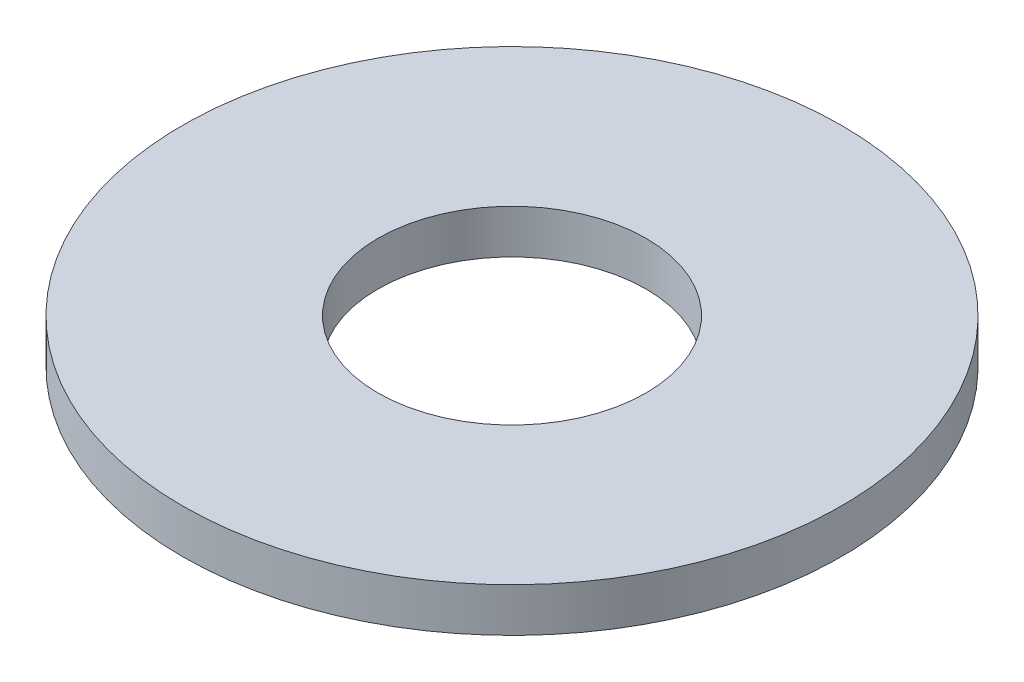
ISO-10303-21;
HEADER;
FILE_DESCRIPTION(('STEP AP214'),'2;1');
FILE_NAME('part.step','',(''),(''),'','','');
FILE_SCHEMA(('AUTOMOTIVE_DESIGN { 1 0 10303 214 1 1 1 1 }'));
ENDSEC;
DATA;
#1=APPLICATION_CONTEXT('core data for automotive mechanical design processes');
#2=APPLICATION_PROTOCOL_DEFINITION('international standard','automotive_design',2000,#1);
#3=PRODUCT_CONTEXT('',#1,'mechanical');
#4=PRODUCT('Part','Part','',(#3));
#5=PRODUCT_RELATED_PRODUCT_CATEGORY('part','',(#4));
#6=PRODUCT_DEFINITION_FORMATION('','',#4);
#7=PRODUCT_DEFINITION_CONTEXT('part definition',#1,'design');
#8=PRODUCT_DEFINITION('design','',#6,#7);
#9=PRODUCT_DEFINITION_SHAPE('','',#8);
#10=(LENGTH_UNIT() NAMED_UNIT(*) SI_UNIT(.MILLI.,.METRE.));
#11=(NAMED_UNIT(*) PLANE_ANGLE_UNIT() SI_UNIT($,.RADIAN.));
#12=(NAMED_UNIT(*) SI_UNIT($,.STERADIAN.) SOLID_ANGLE_UNIT());
#13=UNCERTAINTY_MEASURE_WITH_UNIT(LENGTH_MEASURE(1.E-05),#10,'distance_accuracy_value','');
#14=(GEOMETRIC_REPRESENTATION_CONTEXT(3) GLOBAL_UNCERTAINTY_ASSIGNED_CONTEXT((#13)) GLOBAL_UNIT_ASSIGNED_CONTEXT((#10,
#11,#12)) REPRESENTATION_CONTEXT('',''));
#15=CARTESIAN_POINT('',(0.,0.,0.));
#16=DIRECTION('',(0.,0.,1.));
#17=DIRECTION('',(1.,0.,0.));
#18=AXIS2_PLACEMENT_3D('',#15,#16,#17);
#19=CARTESIAN_POINT('',(0.,1.,0.));
#20=DIRECTION('',(0.,1.,0.));
#21=DIRECTION('',(0.,0.,1.));
#22=AXIS2_PLACEMENT_3D('',#19,#20,#21);
#23=PLANE('',#22);
#24=CARTESIAN_POINT('',(0.,1.,0.));
#25=DIRECTION('',(0.,1.,0.));
#26=DIRECTION('',(0.,0.,1.));
#27=AXIS2_PLACEMENT_3D('',#24,#25,#26);
#28=CIRCLE('',#27,7.5);
#29=CARTESIAN_POINT('',(0.,1.,7.5));
#30=VERTEX_POINT('',#29);
#31=EDGE_CURVE('E10',#30,#30,#28,.T.);
#32=ORIENTED_EDGE('',*,*,#31,.T.);
#33=EDGE_LOOP('',(#32));
#34=FACE_BOUND('',#33,.T.);
#35=CARTESIAN_POINT('',(0.,1.,0.));
#36=DIRECTION('',(0.,1.,0.));
#37=DIRECTION('',(0.,0.,1.));
#38=AXIS2_PLACEMENT_3D('',#35,#36,#37);
#39=CIRCLE('',#38,3.05);
#40=CARTESIAN_POINT('',(0.,1.,3.05));
#41=VERTEX_POINT('',#40);
#42=EDGE_CURVE('E41',#41,#41,#39,.T.);
#43=ORIENTED_EDGE('',*,*,#42,.F.);
#44=EDGE_LOOP('',(#43));
#45=FACE_BOUND('',#44,.T.);
#46=ADVANCED_FACE('F30',(#34,#45),#23,.T.);
#47=CARTESIAN_POINT('',(0.,0.,0.));
#48=DIRECTION('',(0.,1.,0.));
#49=DIRECTION('',(0.,0.,1.));
#50=AXIS2_PLACEMENT_3D('',#47,#48,#49);
#51=PLANE('',#50);
#52=CARTESIAN_POINT('',(0.,0.,0.));
#53=DIRECTION('',(0.,1.,0.));
#54=DIRECTION('',(0.,0.,1.));
#55=AXIS2_PLACEMENT_3D('',#52,#53,#54);
#56=CIRCLE('',#55,7.5);
#57=CARTESIAN_POINT('',(0.,0.,7.5));
#58=VERTEX_POINT('',#57);
#59=EDGE_CURVE('E34',#58,#58,#56,.T.);
#60=ORIENTED_EDGE('',*,*,#59,.F.);
#61=EDGE_LOOP('',(#60));
#62=FACE_BOUND('',#61,.T.);
#63=CARTESIAN_POINT('',(0.,0.,0.));
#64=DIRECTION('',(0.,1.,0.));
#65=DIRECTION('',(0.,0.,1.));
#66=AXIS2_PLACEMENT_3D('',#63,#64,#65);
#67=CIRCLE('',#66,3.05);
#68=CARTESIAN_POINT('',(0.,0.,3.05));
#69=VERTEX_POINT('',#68);
#70=EDGE_CURVE('E43',#69,#69,#67,.T.);
#71=ORIENTED_EDGE('',*,*,#70,.T.);
#72=EDGE_LOOP('',(#71));
#73=FACE_BOUND('',#72,.T.);
#74=ADVANCED_FACE('F53',(#62,#73),#51,.F.);
#75=CARTESIAN_POINT('',(0.,1.,0.));
#76=DIRECTION('',(0.,-1.,0.));
#77=DIRECTION('',(0.,0.,-1.));
#78=AXIS2_PLACEMENT_3D('',#75,#76,#77);
#79=CYLINDRICAL_SURFACE('',#78,7.5);
#80=ORIENTED_EDGE('',*,*,#31,.F.);
#81=EDGE_LOOP('',(#80));
#82=FACE_BOUND('',#81,.T.);
#83=ORIENTED_EDGE('',*,*,#59,.T.);
#84=EDGE_LOOP('',(#83));
#85=FACE_BOUND('',#84,.T.);
#86=ADVANCED_FACE('F32',(#82,#85),#79,.T.);
#87=CARTESIAN_POINT('',(0.,1.,0.));
#88=DIRECTION('',(0.,-1.,0.));
#89=DIRECTION('',(0.,0.,-1.));
#90=AXIS2_PLACEMENT_3D('',#87,#88,#89);
#91=CYLINDRICAL_SURFACE('',#90,3.05);
#92=ORIENTED_EDGE('',*,*,#42,.T.);
#93=EDGE_LOOP('',(#92));
#94=FACE_BOUND('',#93,.T.);
#95=ORIENTED_EDGE('',*,*,#70,.F.);
#96=EDGE_LOOP('',(#95));
#97=FACE_BOUND('',#96,.T.);
#98=ADVANCED_FACE('F49',(#94,#97),#91,.F.);
#99=CLOSED_SHELL('',(#46,#74,#86,#98));
#100=MANIFOLD_SOLID_BREP('B2',#99);
#101=ADVANCED_BREP_SHAPE_REPRESENTATION('',(#18,#100),#14);
#102=SHAPE_DEFINITION_REPRESENTATION(#9,#101);
ENDSEC;
END-ISO-10303-21;
